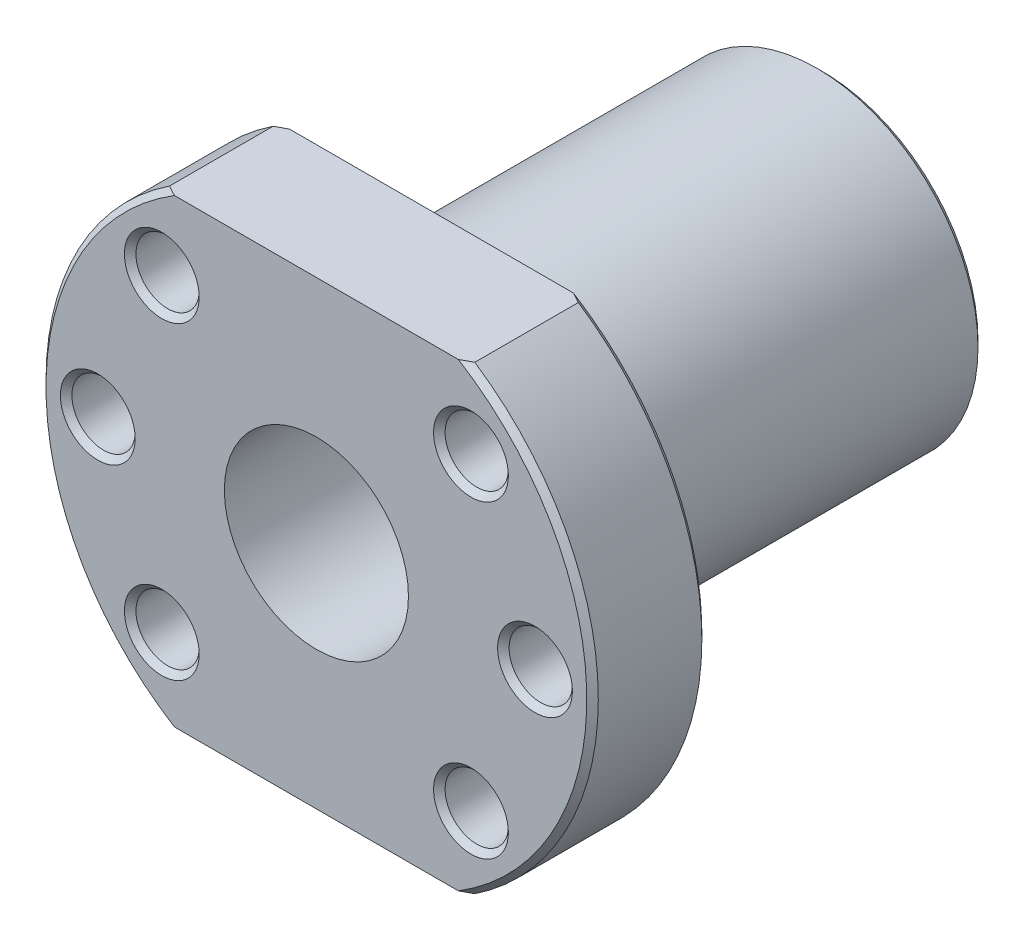
ISO-10303-21;
HEADER;
FILE_DESCRIPTION(('STEP AP214'),'2;1');
FILE_NAME('part.step','',(''),(''),'','','');
FILE_SCHEMA(('AUTOMOTIVE_DESIGN { 1 0 10303 214 1 1 1 1 }'));
ENDSEC;
DATA;
#1=APPLICATION_CONTEXT('core data for automotive mechanical design processes');
#2=APPLICATION_PROTOCOL_DEFINITION('international standard','automotive_design',2000,#1);
#3=PRODUCT_CONTEXT('',#1,'mechanical');
#4=PRODUCT('Part','Part','',(#3));
#5=PRODUCT_RELATED_PRODUCT_CATEGORY('part','',(#4));
#6=PRODUCT_DEFINITION_FORMATION('','',#4);
#7=PRODUCT_DEFINITION_CONTEXT('part definition',#1,'design');
#8=PRODUCT_DEFINITION('design','',#6,#7);
#9=PRODUCT_DEFINITION_SHAPE('','',#8);
#10=(LENGTH_UNIT() NAMED_UNIT(*) SI_UNIT(.MILLI.,.METRE.));
#11=(NAMED_UNIT(*) PLANE_ANGLE_UNIT() SI_UNIT($,.RADIAN.));
#12=(NAMED_UNIT(*) SI_UNIT($,.STERADIAN.) SOLID_ANGLE_UNIT());
#13=UNCERTAINTY_MEASURE_WITH_UNIT(LENGTH_MEASURE(1.E-05),#10,'distance_accuracy_value','');
#14=(GEOMETRIC_REPRESENTATION_CONTEXT(3) GLOBAL_UNCERTAINTY_ASSIGNED_CONTEXT((#13)) GLOBAL_UNIT_ASSIGNED_CONTEXT((#10,
#11,#12)) REPRESENTATION_CONTEXT('',''));
#15=CARTESIAN_POINT('',(0.,0.,0.));
#16=DIRECTION('',(0.,0.,1.));
#17=DIRECTION('',(1.,0.,0.));
#18=AXIS2_PLACEMENT_3D('',#15,#16,#17);
#19=CARTESIAN_POINT('',(0.,0.,0.));
#20=DIRECTION('',(0.,0.,1.));
#21=DIRECTION('',(1.,0.,0.));
#22=AXIS2_PLACEMENT_3D('',#19,#20,#21);
#23=PLANE('',#22);
#24=CARTESIAN_POINT('',(19.,0.,0.));
#25=DIRECTION('',(0.,0.,1.));
#26=DIRECTION('',(1.,0.,0.));
#27=AXIS2_PLACEMENT_3D('',#24,#25,#26);
#28=CIRCLE('',#27,2.75);
#29=CARTESIAN_POINT('',(21.75,0.,0.));
#30=VERTEX_POINT('',#29);
#31=EDGE_CURVE('E298',#30,#30,#28,.T.);
#32=ORIENTED_EDGE('',*,*,#31,.T.);
#33=EDGE_LOOP('',(#32));
#34=FACE_BOUND('',#33,.T.);
#35=CARTESIAN_POINT('',(0.,0.,0.));
#36=DIRECTION('',(0.,0.,1.));
#37=DIRECTION('',(1.,0.,0.));
#38=AXIS2_PLACEMENT_3D('',#35,#36,#37);
#39=CIRCLE('',#38,14.);
#40=CARTESIAN_POINT('',(14.,0.,0.));
#41=VERTEX_POINT('',#40);
#42=EDGE_CURVE('E222',#41,#41,#39,.F.);
#43=ORIENTED_EDGE('',*,*,#42,.F.);
#44=EDGE_LOOP('',(#43));
#45=FACE_BOUND('',#44,.T.);
#46=DIRECTION('',(-1.,0.,0.));
#47=VECTOR('',#46,1.);
#48=CARTESIAN_POINT('',(-44.2311612413135,20.,0.));
#49=LINE('',#48,#47);
#50=CARTESIAN_POINT('',(12.3389626792531,20.,0.));
#51=VERTEX_POINT('',#50);
#52=CARTESIAN_POINT('',(-12.3389626792531,20.,0.));
#53=VERTEX_POINT('',#52);
#54=EDGE_CURVE('E220',#51,#53,#49,.T.);
#55=ORIENTED_EDGE('',*,*,#54,.F.);
#56=CARTESIAN_POINT('',(0.,0.,0.));
#57=DIRECTION('',(0.,0.,1.));
#58=DIRECTION('',(1.,0.,0.));
#59=AXIS2_PLACEMENT_3D('',#56,#57,#58);
#60=CIRCLE('',#59,23.5);
#61=CARTESIAN_POINT('',(12.3389626792531,-20.,0.));
#62=VERTEX_POINT('',#61);
#63=EDGE_CURVE('E559',#51,#62,#60,.F.);
#64=ORIENTED_EDGE('',*,*,#63,.T.);
#65=DIRECTION('',(1.,0.,0.));
#66=VECTOR('',#65,1.);
#67=CARTESIAN_POINT('',(-33.7730280926252,-20.,0.));
#68=LINE('',#67,#66);
#69=CARTESIAN_POINT('',(-12.3389626792531,-20.,0.));
#70=VERTEX_POINT('',#69);
#71=EDGE_CURVE('E107',#70,#62,#68,.T.);
#72=ORIENTED_EDGE('',*,*,#71,.F.);
#73=CARTESIAN_POINT('',(0.,0.,0.));
#74=DIRECTION('',(0.,0.,1.));
#75=DIRECTION('',(1.,0.,0.));
#76=AXIS2_PLACEMENT_3D('',#73,#74,#75);
#77=CIRCLE('',#76,23.5);
#78=EDGE_CURVE('E556',#70,#53,#77,.F.);
#79=ORIENTED_EDGE('',*,*,#78,.T.);
#80=EDGE_LOOP('',(#55,#64,#72,#79));
#81=FACE_BOUND('',#80,.T.);
#82=CARTESIAN_POINT('',(-13.4350288425444,13.4350288425444,0.));
#83=DIRECTION('',(0.,0.,1.));
#84=DIRECTION('',(1.,0.,0.));
#85=AXIS2_PLACEMENT_3D('',#82,#83,#84);
#86=CIRCLE('',#85,2.75);
#87=CARTESIAN_POINT('',(-10.6850288425444,13.4350288425444,0.));
#88=VERTEX_POINT('',#87);
#89=EDGE_CURVE('E284',#88,#88,#86,.F.);
#90=ORIENTED_EDGE('',*,*,#89,.F.);
#91=EDGE_LOOP('',(#90));
#92=FACE_BOUND('',#91,.T.);
#93=CARTESIAN_POINT('',(-19.,0.,0.));
#94=DIRECTION('',(0.,0.,1.));
#95=DIRECTION('',(1.,0.,0.));
#96=AXIS2_PLACEMENT_3D('',#93,#94,#95);
#97=CIRCLE('',#96,2.75);
#98=CARTESIAN_POINT('',(-16.25,0.,0.));
#99=VERTEX_POINT('',#98);
#100=EDGE_CURVE('E289',#99,#99,#97,.F.);
#101=ORIENTED_EDGE('',*,*,#100,.F.);
#102=EDGE_LOOP('',(#101));
#103=FACE_BOUND('',#102,.T.);
#104=CARTESIAN_POINT('',(-13.4350288425443,-13.4350288425445,0.));
#105=DIRECTION('',(0.,0.,1.));
#106=DIRECTION('',(1.,0.,0.));
#107=AXIS2_PLACEMENT_3D('',#104,#105,#106);
#108=CIRCLE('',#107,2.75);
#109=CARTESIAN_POINT('',(-10.6850288425443,-13.4350288425445,0.));
#110=VERTEX_POINT('',#109);
#111=EDGE_CURVE('E292',#110,#110,#108,.F.);
#112=ORIENTED_EDGE('',*,*,#111,.F.);
#113=EDGE_LOOP('',(#112));
#114=FACE_BOUND('',#113,.T.);
#115=CARTESIAN_POINT('',(13.4350288425444,13.4350288425444,0.));
#116=DIRECTION('',(0.,0.,1.));
#117=DIRECTION('',(1.,0.,0.));
#118=AXIS2_PLACEMENT_3D('',#115,#116,#117);
#119=CIRCLE('',#118,2.75);
#120=CARTESIAN_POINT('',(16.1850288425444,13.4350288425444,0.));
#121=VERTEX_POINT('',#120);
#122=EDGE_CURVE('E295',#121,#121,#119,.T.);
#123=ORIENTED_EDGE('',*,*,#122,.T.);
#124=EDGE_LOOP('',(#123));
#125=FACE_BOUND('',#124,.T.);
#126=CARTESIAN_POINT('',(13.4350288425443,-13.4350288425445,0.));
#127=DIRECTION('',(0.,0.,1.));
#128=DIRECTION('',(1.,0.,0.));
#129=AXIS2_PLACEMENT_3D('',#126,#127,#128);
#130=CIRCLE('',#129,2.75);
#131=CARTESIAN_POINT('',(16.1850288425443,-13.4350288425445,0.));
#132=VERTEX_POINT('',#131);
#133=EDGE_CURVE('E301',#132,#132,#130,.T.);
#134=ORIENTED_EDGE('',*,*,#133,.T.);
#135=EDGE_LOOP('',(#134));
#136=FACE_BOUND('',#135,.T.);
#137=ADVANCED_FACE('F34',(#34,#45,#81,#92,#103,#114,#125,#136),#23,.F.);
#138=CARTESIAN_POINT('',(0.,0.,10.));
#139=DIRECTION('',(0.,0.,1.));
#140=DIRECTION('',(1.,0.,0.));
#141=AXIS2_PLACEMENT_3D('',#138,#139,#140);
#142=PLANE('',#141);
#143=CARTESIAN_POINT('',(13.4350288425443,-13.4350288425445,10.));
#144=DIRECTION('',(0.,0.,1.));
#145=DIRECTION('',(1.,0.,0.));
#146=AXIS2_PLACEMENT_3D('',#143,#144,#145);
#147=CIRCLE('',#146,3.25);
#148=CARTESIAN_POINT('',(16.6850288425443,-13.4350288425445,10.));
#149=VERTEX_POINT('',#148);
#150=EDGE_CURVE('E249',#149,#149,#147,.F.);
#151=ORIENTED_EDGE('',*,*,#150,.T.);
#152=EDGE_LOOP('',(#151));
#153=FACE_BOUND('',#152,.T.);
#154=CARTESIAN_POINT('',(19.,0.,10.));
#155=DIRECTION('',(0.,0.,1.));
#156=DIRECTION('',(1.,0.,0.));
#157=AXIS2_PLACEMENT_3D('',#154,#155,#156);
#158=CIRCLE('',#157,3.25);
#159=CARTESIAN_POINT('',(22.25,0.,10.));
#160=VERTEX_POINT('',#159);
#161=EDGE_CURVE('E246',#160,#160,#158,.F.);
#162=ORIENTED_EDGE('',*,*,#161,.T.);
#163=EDGE_LOOP('',(#162));
#164=FACE_BOUND('',#163,.T.);
#165=CARTESIAN_POINT('',(13.4350288425444,13.4350288425444,10.));
#166=DIRECTION('',(0.,0.,1.));
#167=DIRECTION('',(1.,0.,0.));
#168=AXIS2_PLACEMENT_3D('',#165,#166,#167);
#169=CIRCLE('',#168,3.25000000000001);
#170=CARTESIAN_POINT('',(16.6850288425444,13.4350288425444,10.));
#171=VERTEX_POINT('',#170);
#172=EDGE_CURVE('E243',#171,#171,#169,.F.);
#173=ORIENTED_EDGE('',*,*,#172,.T.);
#174=EDGE_LOOP('',(#173));
#175=FACE_BOUND('',#174,.T.);
#176=DIRECTION('',(-1.,0.,0.));
#177=VECTOR('',#176,1.);
#178=CARTESIAN_POINT('',(-33.7730280926252,-20.,10.));
#179=LINE('',#178,#177);
#180=CARTESIAN_POINT('',(12.3389626792531,-20.,10.));
#181=VERTEX_POINT('',#180);
#182=CARTESIAN_POINT('',(-12.3389626792531,-20.,10.));
#183=VERTEX_POINT('',#182);
#184=EDGE_CURVE('E122',#181,#183,#179,.T.);
#185=ORIENTED_EDGE('',*,*,#184,.F.);
#186=CARTESIAN_POINT('',(0.,0.,10.));
#187=DIRECTION('',(0.,0.,1.));
#188=DIRECTION('',(1.,0.,0.));
#189=AXIS2_PLACEMENT_3D('',#186,#187,#188);
#190=CIRCLE('',#189,23.5);
#191=CARTESIAN_POINT('',(12.3389626792531,20.,10.));
#192=VERTEX_POINT('',#191);
#193=EDGE_CURVE('E191',#181,#192,#190,.T.);
#194=ORIENTED_EDGE('',*,*,#193,.T.);
#195=DIRECTION('',(1.,0.,0.));
#196=VECTOR('',#195,1.);
#197=CARTESIAN_POINT('',(-44.2311612413135,20.,10.));
#198=LINE('',#197,#196);
#199=CARTESIAN_POINT('',(-12.3389626792531,20.,10.));
#200=VERTEX_POINT('',#199);
#201=EDGE_CURVE('E205',#200,#192,#198,.T.);
#202=ORIENTED_EDGE('',*,*,#201,.F.);
#203=CARTESIAN_POINT('',(0.,0.,10.));
#204=DIRECTION('',(0.,0.,1.));
#205=DIRECTION('',(1.,0.,0.));
#206=AXIS2_PLACEMENT_3D('',#203,#204,#205);
#207=CIRCLE('',#206,23.5);
#208=EDGE_CURVE('E111',#200,#183,#207,.T.);
#209=ORIENTED_EDGE('',*,*,#208,.T.);
#210=EDGE_LOOP('',(#185,#194,#202,#209));
#211=FACE_BOUND('',#210,.T.);
#212=CARTESIAN_POINT('',(0.,0.,10.));
#213=DIRECTION('',(0.,0.,1.));
#214=DIRECTION('',(1.,0.,0.));
#215=AXIS2_PLACEMENT_3D('',#212,#213,#214);
#216=CIRCLE('',#215,8.);
#217=CARTESIAN_POINT('',(8.,0.,10.));
#218=VERTEX_POINT('',#217);
#219=EDGE_CURVE('E281',#218,#218,#216,.F.);
#220=ORIENTED_EDGE('',*,*,#219,.T.);
#221=EDGE_LOOP('',(#220));
#222=FACE_BOUND('',#221,.T.);
#223=CARTESIAN_POINT('',(-13.4350288425444,13.4350288425444,10.));
#224=DIRECTION('',(0.,0.,1.));
#225=DIRECTION('',(1.,0.,0.));
#226=AXIS2_PLACEMENT_3D('',#223,#224,#225);
#227=CIRCLE('',#226,3.25000000000001);
#228=CARTESIAN_POINT('',(-10.1850288425444,13.4350288425444,10.));
#229=VERTEX_POINT('',#228);
#230=EDGE_CURVE('E228',#229,#229,#227,.F.);
#231=ORIENTED_EDGE('',*,*,#230,.T.);
#232=EDGE_LOOP('',(#231));
#233=FACE_BOUND('',#232,.T.);
#234=CARTESIAN_POINT('',(-19.,0.,10.));
#235=DIRECTION('',(0.,0.,1.));
#236=DIRECTION('',(1.,0.,0.));
#237=AXIS2_PLACEMENT_3D('',#234,#235,#236);
#238=CIRCLE('',#237,3.24999999999997);
#239=CARTESIAN_POINT('',(-15.75,0.,10.));
#240=VERTEX_POINT('',#239);
#241=EDGE_CURVE('E231',#240,#240,#238,.F.);
#242=ORIENTED_EDGE('',*,*,#241,.T.);
#243=EDGE_LOOP('',(#242));
#244=FACE_BOUND('',#243,.T.);
#245=CARTESIAN_POINT('',(-13.4350288425443,-13.4350288425445,10.));
#246=DIRECTION('',(0.,0.,1.));
#247=DIRECTION('',(1.,0.,0.));
#248=AXIS2_PLACEMENT_3D('',#245,#246,#247);
#249=CIRCLE('',#248,3.24999999999999);
#250=CARTESIAN_POINT('',(-10.1850288425443,-13.4350288425445,10.));
#251=VERTEX_POINT('',#250);
#252=EDGE_CURVE('E234',#251,#251,#249,.F.);
#253=ORIENTED_EDGE('',*,*,#252,.T.);
#254=EDGE_LOOP('',(#253));
#255=FACE_BOUND('',#254,.T.);
#256=ADVANCED_FACE('F211',(#153,#164,#175,#211,#222,#233,#244,#255),#142,.T.);
#257=CARTESIAN_POINT('',(0.,0.,10.));
#258=DIRECTION('',(0.,0.,-1.));
#259=DIRECTION('',(-1.,0.,0.));
#260=AXIS2_PLACEMENT_3D('',#257,#258,#259);
#261=CYLINDRICAL_SURFACE('',#260,24.);
#262=DIRECTION('',(0.,0.,-1.));
#263=VECTOR('',#262,1.);
#264=CARTESIAN_POINT('',(13.2664991614216,-20.,10.));
#265=LINE('',#264,#263);
#266=CARTESIAN_POINT('',(13.2664991614216,-20.,0.499999999999997));
#267=VERTEX_POINT('',#266);
#268=CARTESIAN_POINT('',(13.2664991614216,-20.,9.5));
#269=VERTEX_POINT('',#268);
#270=EDGE_CURVE('E104',#267,#269,#265,.F.);
#271=ORIENTED_EDGE('',*,*,#270,.F.);
#272=CARTESIAN_POINT('',(0.,0.,0.499999999999997));
#273=DIRECTION('',(0.,0.,1.));
#274=DIRECTION('',(1.,0.,0.));
#275=AXIS2_PLACEMENT_3D('',#272,#273,#274);
#276=CIRCLE('',#275,24.);
#277=CARTESIAN_POINT('',(13.2664991614216,20.,0.499999999999997));
#278=VERTEX_POINT('',#277);
#279=EDGE_CURVE('E118',#267,#278,#276,.T.);
#280=ORIENTED_EDGE('',*,*,#279,.T.);
#281=DIRECTION('',(0.,0.,-1.));
#282=VECTOR('',#281,1.);
#283=CARTESIAN_POINT('',(13.2664991614216,20.,10.));
#284=LINE('',#283,#282);
#285=CARTESIAN_POINT('',(13.2664991614216,20.,9.5));
#286=VERTEX_POINT('',#285);
#287=EDGE_CURVE('E206',#286,#278,#284,.T.);
#288=ORIENTED_EDGE('',*,*,#287,.F.);
#289=CARTESIAN_POINT('',(0.,0.,9.5));
#290=DIRECTION('',(0.,0.,1.));
#291=DIRECTION('',(1.,0.,0.));
#292=AXIS2_PLACEMENT_3D('',#289,#290,#291);
#293=CIRCLE('',#292,24.);
#294=EDGE_CURVE('E121',#286,#269,#293,.F.);
#295=ORIENTED_EDGE('',*,*,#294,.T.);
#296=EDGE_LOOP('',(#271,#280,#288,#295));
#297=FACE_BOUND('',#296,.T.);
#298=ADVANCED_FACE('F116',(#297),#261,.T.);
#299=DIRECTION('',(0.,0.,-1.));
#300=VECTOR('',#299,1.);
#301=CARTESIAN_POINT('',(-13.2664991614216,20.,10.));
#302=LINE('',#301,#300);
#303=CARTESIAN_POINT('',(-13.2664991614216,20.,0.499999999999997));
#304=VERTEX_POINT('',#303);
#305=CARTESIAN_POINT('',(-13.2664991614216,20.,9.5));
#306=VERTEX_POINT('',#305);
#307=EDGE_CURVE('E198',#304,#306,#302,.F.);
#308=ORIENTED_EDGE('',*,*,#307,.F.);
#309=CARTESIAN_POINT('',(0.,0.,0.499999999999997));
#310=DIRECTION('',(0.,0.,1.));
#311=DIRECTION('',(1.,0.,0.));
#312=AXIS2_PLACEMENT_3D('',#309,#310,#311);
#313=CIRCLE('',#312,24.);
#314=CARTESIAN_POINT('',(-13.2664991614216,-20.,0.499999999999997));
#315=VERTEX_POINT('',#314);
#316=EDGE_CURVE('E11',#304,#315,#313,.T.);
#317=ORIENTED_EDGE('',*,*,#316,.T.);
#318=DIRECTION('',(0.,0.,-1.));
#319=VECTOR('',#318,1.);
#320=CARTESIAN_POINT('',(-13.2664991614216,-20.,10.));
#321=LINE('',#320,#319);
#322=CARTESIAN_POINT('',(-13.2664991614216,-20.,9.5));
#323=VERTEX_POINT('',#322);
#324=EDGE_CURVE('E123',#323,#315,#321,.T.);
#325=ORIENTED_EDGE('',*,*,#324,.F.);
#326=CARTESIAN_POINT('',(0.,0.,9.5));
#327=DIRECTION('',(0.,0.,1.));
#328=DIRECTION('',(1.,0.,0.));
#329=AXIS2_PLACEMENT_3D('',#326,#327,#328);
#330=CIRCLE('',#329,24.);
#331=EDGE_CURVE('E43',#323,#306,#330,.F.);
#332=ORIENTED_EDGE('',*,*,#331,.T.);
#333=EDGE_LOOP('',(#308,#317,#325,#332));
#334=FACE_BOUND('',#333,.T.);
#335=ADVANCED_FACE('F197',(#334),#261,.T.);
#336=CARTESIAN_POINT('',(0.,0.,-34.));
#337=DIRECTION('',(0.,0.,1.));
#338=DIRECTION('',(1.,0.,0.));
#339=AXIS2_PLACEMENT_3D('',#336,#337,#338);
#340=CYLINDRICAL_SURFACE('',#339,14.);
#341=CARTESIAN_POINT('',(0.,0.,-33.5));
#342=DIRECTION('',(0.,0.,-1.));
#343=DIRECTION('',(-1.,0.,0.));
#344=AXIS2_PLACEMENT_3D('',#341,#342,#343);
#345=CIRCLE('',#344,14.);
#346=CARTESIAN_POINT('',(-14.,0.,-33.5));
#347=VERTEX_POINT('',#346);
#348=EDGE_CURVE('E131',#347,#347,#345,.F.);
#349=ORIENTED_EDGE('',*,*,#348,.T.);
#350=EDGE_LOOP('',(#349));
#351=FACE_BOUND('',#350,.T.);
#352=ORIENTED_EDGE('',*,*,#42,.T.);
#353=EDGE_LOOP('',(#352));
#354=FACE_BOUND('',#353,.T.);
#355=ADVANCED_FACE('F266',(#351,#354),#340,.T.);
#356=CARTESIAN_POINT('',(0.,0.,-34.));
#357=DIRECTION('',(0.,0.,-1.));
#358=DIRECTION('',(-1.,0.,0.));
#359=AXIS2_PLACEMENT_3D('',#356,#357,#358);
#360=PLANE('',#359);
#361=CARTESIAN_POINT('',(0.,0.,-34.));
#362=DIRECTION('',(0.,0.,-1.));
#363=DIRECTION('',(-1.,0.,0.));
#364=AXIS2_PLACEMENT_3D('',#361,#362,#363);
#365=CIRCLE('',#364,13.5);
#366=CARTESIAN_POINT('',(-13.5,0.,-34.));
#367=VERTEX_POINT('',#366);
#368=EDGE_CURVE('E261',#367,#367,#365,.T.);
#369=ORIENTED_EDGE('',*,*,#368,.T.);
#370=EDGE_LOOP('',(#369));
#371=FACE_BOUND('',#370,.T.);
#372=CARTESIAN_POINT('',(0.,0.,-34.));
#373=DIRECTION('',(0.,0.,-1.));
#374=DIRECTION('',(-1.,0.,0.));
#375=AXIS2_PLACEMENT_3D('',#372,#373,#374);
#376=CIRCLE('',#375,8.);
#377=CARTESIAN_POINT('',(-8.,0.,-34.));
#378=VERTEX_POINT('',#377);
#379=EDGE_CURVE('E279',#378,#378,#376,.T.);
#380=ORIENTED_EDGE('',*,*,#379,.F.);
#381=EDGE_LOOP('',(#380));
#382=FACE_BOUND('',#381,.T.);
#383=ADVANCED_FACE('F148',(#371,#382),#360,.T.);
#384=CARTESIAN_POINT('',(-44.2311612413135,20.,-34.001));
#385=DIRECTION('',(0.,-1.,0.));
#386=DIRECTION('',(0.,0.,-1.));
#387=AXIS2_PLACEMENT_3D('',#384,#385,#386);
#388=PLANE('',#387);
#389=ORIENTED_EDGE('',*,*,#287,.T.);
#390=CARTESIAN_POINT('',(13.2664991614216,20.,0.499999999999997));
#391=CARTESIAN_POINT('',(13.1128042922851,20.,0.41500733347907));
#392=CARTESIAN_POINT('',(12.9586621744438,20.,0.33084434593532));
#393=CARTESIAN_POINT('',(12.6494833475968,20.,0.164177678262288));
#394=CARTESIAN_POINT('',(12.4944466380485,20.,0.0816739991393728));
#395=CARTESIAN_POINT('',(12.3389626792531,20.,0.));
#396=B_SPLINE_CURVE_WITH_KNOTS('',3,(#390,#391,#392,#393,#394,#395),.UNSPECIFIED.,.F.,.F.,(4,2,
4),(0.,0.526866974371925,1.05373426827748),.UNSPECIFIED.);
#397=EDGE_CURVE('E126',#278,#51,#396,.T.);
#398=ORIENTED_EDGE('',*,*,#397,.T.);
#399=ORIENTED_EDGE('',*,*,#54,.T.);
#400=CARTESIAN_POINT('',(-12.3389626792531,20.,0.));
#401=CARTESIAN_POINT('',(-12.4944466380485,20.,0.0816739991393734));
#402=CARTESIAN_POINT('',(-12.6494833475968,20.,0.164177678262289));
#403=CARTESIAN_POINT('',(-12.9586621744438,20.,0.33084434593532));
#404=CARTESIAN_POINT('',(-13.1128042922851,20.,0.415007333479071));
#405=CARTESIAN_POINT('',(-13.2664991614216,20.,0.499999999999998));
#406=B_SPLINE_CURVE_WITH_KNOTS('',3,(#400,#401,#402,#403,#404,#405),.UNSPECIFIED.,.F.,.F.,(4,2,
4),(0.,0.526867293905557,1.05373426827748),.UNSPECIFIED.);
#407=EDGE_CURVE('E129',#53,#304,#406,.T.);
#408=ORIENTED_EDGE('',*,*,#407,.T.);
#409=ORIENTED_EDGE('',*,*,#307,.T.);
#410=CARTESIAN_POINT('',(-13.2664991614216,20.,9.5));
#411=CARTESIAN_POINT('',(-13.1128042922851,20.,9.58499266652093));
#412=CARTESIAN_POINT('',(-12.9586621744438,20.,9.66915565406468));
#413=CARTESIAN_POINT('',(-12.6494833475968,20.,9.83582232173771));
#414=CARTESIAN_POINT('',(-12.4944466380485,20.,9.91832600086063));
#415=CARTESIAN_POINT('',(-12.3389626792531,20.,10.));
#416=B_SPLINE_CURVE_WITH_KNOTS('',3,(#410,#411,#412,#413,#414,#415),.UNSPECIFIED.,.F.,.F.,(4,2,
4),(0.,0.526866974371928,1.05373426827749),.UNSPECIFIED.);
#417=EDGE_CURVE('E127',#306,#200,#416,.T.);
#418=ORIENTED_EDGE('',*,*,#417,.T.);
#419=ORIENTED_EDGE('',*,*,#201,.T.);
#420=CARTESIAN_POINT('',(12.3389626792531,20.,10.));
#421=CARTESIAN_POINT('',(12.4944466380485,20.,9.91832600086063));
#422=CARTESIAN_POINT('',(12.6494833475968,20.,9.83582232173771));
#423=CARTESIAN_POINT('',(12.9586621744438,20.,9.66915565406468));
#424=CARTESIAN_POINT('',(13.1128042922851,20.,9.58499266652093));
#425=CARTESIAN_POINT('',(13.2664991614216,20.,9.5));
#426=B_SPLINE_CURVE_WITH_KNOTS('',3,(#420,#421,#422,#423,#424,#425),.UNSPECIFIED.,.F.,.F.,(4,2,
4),(0.,0.526867293905557,1.05373426827748),.UNSPECIFIED.);
#427=EDGE_CURVE('E157',#192,#286,#426,.T.);
#428=ORIENTED_EDGE('',*,*,#427,.T.);
#429=EDGE_LOOP('',(#389,#398,#399,#408,#409,#418,#419,#428));
#430=FACE_BOUND('',#429,.T.);
#431=ADVANCED_FACE('F143',(#430),#388,.F.);
#432=CARTESIAN_POINT('',(-33.7730280926252,-20.,-34.001));
#433=DIRECTION('',(0.,1.,0.));
#434=DIRECTION('',(0.,0.,1.));
#435=AXIS2_PLACEMENT_3D('',#432,#433,#434);
#436=PLANE('',#435);
#437=ORIENTED_EDGE('',*,*,#71,.T.);
#438=CARTESIAN_POINT('',(12.3389626792531,-20.,0.));
#439=CARTESIAN_POINT('',(12.4944466380485,-20.,0.0816739991393734));
#440=CARTESIAN_POINT('',(12.6494833475968,-20.,0.164177678262289));
#441=CARTESIAN_POINT('',(12.9586621744438,-20.,0.33084434593532));
#442=CARTESIAN_POINT('',(13.1128042922851,-20.,0.415007333479071));
#443=CARTESIAN_POINT('',(13.2664991614216,-20.,0.499999999999998));
#444=B_SPLINE_CURVE_WITH_KNOTS('',3,(#438,#439,#440,#441,#442,#443),.UNSPECIFIED.,.F.,.F.,(4,2,
4),(0.,0.526867293905557,1.05373426827748),.UNSPECIFIED.);
#445=EDGE_CURVE('E101',#62,#267,#444,.T.);
#446=ORIENTED_EDGE('',*,*,#445,.T.);
#447=ORIENTED_EDGE('',*,*,#270,.T.);
#448=CARTESIAN_POINT('',(13.2664991614216,-20.,9.5));
#449=CARTESIAN_POINT('',(13.1128042922851,-20.,9.58499266652093));
#450=CARTESIAN_POINT('',(12.9586621744438,-20.,9.66915565406468));
#451=CARTESIAN_POINT('',(12.6494833475968,-20.,9.83582232173771));
#452=CARTESIAN_POINT('',(12.4944466380485,-20.,9.91832600086063));
#453=CARTESIAN_POINT('',(12.3389626792531,-20.,10.));
#454=B_SPLINE_CURVE_WITH_KNOTS('',3,(#448,#449,#450,#451,#452,#453),.UNSPECIFIED.,.F.,.F.,(4,2,
4),(0.,0.526866974371928,1.05373426827749),.UNSPECIFIED.);
#455=EDGE_CURVE('E112',#269,#181,#454,.T.);
#456=ORIENTED_EDGE('',*,*,#455,.T.);
#457=ORIENTED_EDGE('',*,*,#184,.T.);
#458=CARTESIAN_POINT('',(-12.3389626792531,-20.,10.));
#459=CARTESIAN_POINT('',(-12.4944466380485,-20.,9.91832600086063));
#460=CARTESIAN_POINT('',(-12.6494833475968,-20.,9.83582232173771));
#461=CARTESIAN_POINT('',(-12.9586621744438,-20.,9.66915565406468));
#462=CARTESIAN_POINT('',(-13.1128042922851,-20.,9.58499266652093));
#463=CARTESIAN_POINT('',(-13.2664991614216,-20.,9.5));
#464=B_SPLINE_CURVE_WITH_KNOTS('',3,(#458,#459,#460,#461,#462,#463),.UNSPECIFIED.,.F.,.F.,(4,2,
4),(0.,0.526867293905557,1.05373426827748),.UNSPECIFIED.);
#465=EDGE_CURVE('E57',#183,#323,#464,.T.);
#466=ORIENTED_EDGE('',*,*,#465,.T.);
#467=ORIENTED_EDGE('',*,*,#324,.T.);
#468=CARTESIAN_POINT('',(-13.2664991614216,-20.,0.499999999999997));
#469=CARTESIAN_POINT('',(-13.1128042922851,-20.,0.41500733347907));
#470=CARTESIAN_POINT('',(-12.9586621744438,-20.,0.33084434593532));
#471=CARTESIAN_POINT('',(-12.6494833475968,-20.,0.164177678262288));
#472=CARTESIAN_POINT('',(-12.4944466380485,-20.,0.0816739991393728));
#473=CARTESIAN_POINT('',(-12.3389626792531,-20.,0.));
#474=B_SPLINE_CURVE_WITH_KNOTS('',3,(#468,#469,#470,#471,#472,#473),.UNSPECIFIED.,.F.,.F.,(4,2,
4),(0.,0.526866974371925,1.05373426827748),.UNSPECIFIED.);
#475=EDGE_CURVE('E50',#315,#70,#474,.T.);
#476=ORIENTED_EDGE('',*,*,#475,.T.);
#477=EDGE_LOOP('',(#437,#446,#447,#456,#457,#466,#467,#476));
#478=FACE_BOUND('',#477,.T.);
#479=ADVANCED_FACE('F103',(#478),#436,.F.);
#480=CARTESIAN_POINT('',(0.,0.,10.001));
#481=DIRECTION('',(0.,0.,-1.));
#482=DIRECTION('',(-1.,0.,0.));
#483=AXIS2_PLACEMENT_3D('',#480,#481,#482);
#484=CYLINDRICAL_SURFACE('',#483,8.);
#485=ORIENTED_EDGE('',*,*,#219,.F.);
#486=EDGE_LOOP('',(#485));
#487=FACE_BOUND('',#486,.T.);
#488=ORIENTED_EDGE('',*,*,#379,.T.);
#489=EDGE_LOOP('',(#488));
#490=FACE_BOUND('',#489,.T.);
#491=ADVANCED_FACE('F376',(#487,#490),#484,.F.);
#492=CARTESIAN_POINT('',(-13.4350288425444,13.4350288425444,-34.001));
#493=DIRECTION('',(0.,0.,1.));
#494=DIRECTION('',(1.,0.,0.));
#495=AXIS2_PLACEMENT_3D('',#492,#493,#494);
#496=CYLINDRICAL_SURFACE('',#495,2.75);
#497=CARTESIAN_POINT('',(-13.4350288425444,13.4350288425444,9.49999999999999));
#498=DIRECTION('',(0.,0.,1.));
#499=DIRECTION('',(1.,0.,0.));
#500=AXIS2_PLACEMENT_3D('',#497,#498,#499);
#501=CIRCLE('',#500,2.75);
#502=CARTESIAN_POINT('',(-10.6850288425444,13.4350288425444,9.49999999999999));
#503=VERTEX_POINT('',#502);
#504=EDGE_CURVE('E240',#503,#503,#501,.T.);
#505=ORIENTED_EDGE('',*,*,#504,.T.);
#506=EDGE_LOOP('',(#505));
#507=FACE_BOUND('',#506,.T.);
#508=ORIENTED_EDGE('',*,*,#89,.T.);
#509=EDGE_LOOP('',(#508));
#510=FACE_BOUND('',#509,.T.);
#511=ADVANCED_FACE('F373',(#507,#510),#496,.F.);
#512=CARTESIAN_POINT('',(-19.,0.,-34.001));
#513=DIRECTION('',(0.,0.,1.));
#514=DIRECTION('',(1.,0.,0.));
#515=AXIS2_PLACEMENT_3D('',#512,#513,#514);
#516=CYLINDRICAL_SURFACE('',#515,2.75);
#517=CARTESIAN_POINT('',(-19.,0.,9.50000000000002));
#518=DIRECTION('',(0.,0.,1.));
#519=DIRECTION('',(1.,0.,0.));
#520=AXIS2_PLACEMENT_3D('',#517,#518,#519);
#521=CIRCLE('',#520,2.75);
#522=CARTESIAN_POINT('',(-16.25,0.,9.50000000000002));
#523=VERTEX_POINT('',#522);
#524=EDGE_CURVE('E237',#523,#523,#521,.T.);
#525=ORIENTED_EDGE('',*,*,#524,.T.);
#526=EDGE_LOOP('',(#525));
#527=FACE_BOUND('',#526,.T.);
#528=ORIENTED_EDGE('',*,*,#100,.T.);
#529=EDGE_LOOP('',(#528));
#530=FACE_BOUND('',#529,.T.);
#531=ADVANCED_FACE('F369',(#527,#530),#516,.F.);
#532=CARTESIAN_POINT('',(-13.4350288425443,-13.4350288425445,-34.001));
#533=DIRECTION('',(0.,0.,1.));
#534=DIRECTION('',(1.,0.,0.));
#535=AXIS2_PLACEMENT_3D('',#532,#533,#534);
#536=CYLINDRICAL_SURFACE('',#535,2.75);
#537=CARTESIAN_POINT('',(-13.4350288425443,-13.4350288425445,9.50000000000001));
#538=DIRECTION('',(0.,0.,1.));
#539=DIRECTION('',(1.,0.,0.));
#540=AXIS2_PLACEMENT_3D('',#537,#538,#539);
#541=CIRCLE('',#540,2.75);
#542=CARTESIAN_POINT('',(-10.6850288425443,-13.4350288425445,9.50000000000001));
#543=VERTEX_POINT('',#542);
#544=EDGE_CURVE('E225',#543,#543,#541,.T.);
#545=ORIENTED_EDGE('',*,*,#544,.T.);
#546=EDGE_LOOP('',(#545));
#547=FACE_BOUND('',#546,.T.);
#548=ORIENTED_EDGE('',*,*,#111,.T.);
#549=EDGE_LOOP('',(#548));
#550=FACE_BOUND('',#549,.T.);
#551=ADVANCED_FACE('F338',(#547,#550),#536,.F.);
#552=CARTESIAN_POINT('',(-13.4350288425443,-13.4350288425445,9.50000000000001));
#553=DIRECTION('',(0.,0.,1.));
#554=DIRECTION('',(1.,0.,0.));
#555=AXIS2_PLACEMENT_3D('',#552,#553,#554);
#556=CONICAL_SURFACE('',#555,2.75,0.785398163397451);
#557=ORIENTED_EDGE('',*,*,#252,.F.);
#558=EDGE_LOOP('',(#557));
#559=FACE_BOUND('',#558,.T.);
#560=ORIENTED_EDGE('',*,*,#544,.F.);
#561=EDGE_LOOP('',(#560));
#562=FACE_BOUND('',#561,.T.);
#563=ADVANCED_FACE('F334',(#559,#562),#556,.F.);
#564=CARTESIAN_POINT('',(-19.,0.,9.50000000000002));
#565=DIRECTION('',(0.,0.,1.));
#566=DIRECTION('',(1.,0.,0.));
#567=AXIS2_PLACEMENT_3D('',#564,#565,#566);
#568=CONICAL_SURFACE('',#567,2.75,0.785398163397446);
#569=ORIENTED_EDGE('',*,*,#241,.F.);
#570=EDGE_LOOP('',(#569));
#571=FACE_BOUND('',#570,.T.);
#572=ORIENTED_EDGE('',*,*,#524,.F.);
#573=EDGE_LOOP('',(#572));
#574=FACE_BOUND('',#573,.T.);
#575=ADVANCED_FACE('F337',(#571,#574),#568,.F.);
#576=CARTESIAN_POINT('',(-13.4350288425444,13.4350288425444,9.49999999999999));
#577=DIRECTION('',(0.,0.,1.));
#578=DIRECTION('',(1.,0.,0.));
#579=AXIS2_PLACEMENT_3D('',#576,#577,#578);
#580=CONICAL_SURFACE('',#579,2.75,0.785398163397451);
#581=ORIENTED_EDGE('',*,*,#230,.F.);
#582=EDGE_LOOP('',(#581));
#583=FACE_BOUND('',#582,.T.);
#584=ORIENTED_EDGE('',*,*,#504,.F.);
#585=EDGE_LOOP('',(#584));
#586=FACE_BOUND('',#585,.T.);
#587=ADVANCED_FACE('F342',(#583,#586),#580,.F.);
#588=CARTESIAN_POINT('',(13.4350288425444,13.4350288425444,-34.001));
#589=DIRECTION('',(0.,0.,1.));
#590=DIRECTION('',(1.,0.,0.));
#591=AXIS2_PLACEMENT_3D('',#588,#589,#590);
#592=CYLINDRICAL_SURFACE('',#591,2.75);
#593=CARTESIAN_POINT('',(13.4350288425444,13.4350288425444,9.49999999999999));
#594=DIRECTION('',(0.,0.,1.));
#595=DIRECTION('',(1.,0.,0.));
#596=AXIS2_PLACEMENT_3D('',#593,#594,#595);
#597=CIRCLE('',#596,2.75);
#598=CARTESIAN_POINT('',(16.1850288425444,13.4350288425444,9.49999999999999));
#599=VERTEX_POINT('',#598);
#600=EDGE_CURVE('E258',#599,#599,#597,.T.);
#601=ORIENTED_EDGE('',*,*,#600,.T.);
#602=EDGE_LOOP('',(#601));
#603=FACE_BOUND('',#602,.T.);
#604=ORIENTED_EDGE('',*,*,#122,.F.);
#605=EDGE_LOOP('',(#604));
#606=FACE_BOUND('',#605,.T.);
#607=ADVANCED_FACE('F319',(#603,#606),#592,.F.);
#608=CARTESIAN_POINT('',(19.,0.,-34.001));
#609=DIRECTION('',(0.,0.,1.));
#610=DIRECTION('',(1.,0.,0.));
#611=AXIS2_PLACEMENT_3D('',#608,#609,#610);
#612=CYLINDRICAL_SURFACE('',#611,2.75);
#613=CARTESIAN_POINT('',(19.,0.,9.49999999999999));
#614=DIRECTION('',(0.,0.,1.));
#615=DIRECTION('',(1.,0.,0.));
#616=AXIS2_PLACEMENT_3D('',#613,#614,#615);
#617=CIRCLE('',#616,2.75);
#618=CARTESIAN_POINT('',(21.75,0.,9.49999999999999));
#619=VERTEX_POINT('',#618);
#620=EDGE_CURVE('E255',#619,#619,#617,.T.);
#621=ORIENTED_EDGE('',*,*,#620,.T.);
#622=EDGE_LOOP('',(#621));
#623=FACE_BOUND('',#622,.T.);
#624=ORIENTED_EDGE('',*,*,#31,.F.);
#625=EDGE_LOOP('',(#624));
#626=FACE_BOUND('',#625,.T.);
#627=ADVANCED_FACE('F309',(#623,#626),#612,.F.);
#628=CARTESIAN_POINT('',(13.4350288425443,-13.4350288425445,-34.001));
#629=DIRECTION('',(0.,0.,1.));
#630=DIRECTION('',(1.,0.,0.));
#631=AXIS2_PLACEMENT_3D('',#628,#629,#630);
#632=CYLINDRICAL_SURFACE('',#631,2.75);
#633=CARTESIAN_POINT('',(13.4350288425443,-13.4350288425445,9.49999999999999));
#634=DIRECTION('',(0.,0.,1.));
#635=DIRECTION('',(1.,0.,0.));
#636=AXIS2_PLACEMENT_3D('',#633,#634,#635);
#637=CIRCLE('',#636,2.75);
#638=CARTESIAN_POINT('',(16.1850288425443,-13.4350288425445,9.49999999999999));
#639=VERTEX_POINT('',#638);
#640=EDGE_CURVE('E252',#639,#639,#637,.T.);
#641=ORIENTED_EDGE('',*,*,#640,.T.);
#642=EDGE_LOOP('',(#641));
#643=FACE_BOUND('',#642,.T.);
#644=ORIENTED_EDGE('',*,*,#133,.F.);
#645=EDGE_LOOP('',(#644));
#646=FACE_BOUND('',#645,.T.);
#647=ADVANCED_FACE('F306',(#643,#646),#632,.F.);
#648=CARTESIAN_POINT('',(13.4350288425443,-13.4350288425445,10.));
#649=DIRECTION('',(0.,0.,1.));
#650=DIRECTION('',(1.,0.,0.));
#651=AXIS2_PLACEMENT_3D('',#648,#649,#650);
#652=CONICAL_SURFACE('',#651,3.25,0.785398163397448);
#653=ORIENTED_EDGE('',*,*,#640,.F.);
#654=EDGE_LOOP('',(#653));
#655=FACE_BOUND('',#654,.T.);
#656=ORIENTED_EDGE('',*,*,#150,.F.);
#657=EDGE_LOOP('',(#656));
#658=FACE_BOUND('',#657,.T.);
#659=ADVANCED_FACE('F308',(#655,#658),#652,.F.);
#660=CARTESIAN_POINT('',(19.,0.,10.));
#661=DIRECTION('',(0.,0.,1.));
#662=DIRECTION('',(1.,0.,0.));
#663=AXIS2_PLACEMENT_3D('',#660,#661,#662);
#664=CONICAL_SURFACE('',#663,3.25000000000001,0.785398163397449);
#665=ORIENTED_EDGE('',*,*,#620,.F.);
#666=EDGE_LOOP('',(#665));
#667=FACE_BOUND('',#666,.T.);
#668=ORIENTED_EDGE('',*,*,#161,.F.);
#669=EDGE_LOOP('',(#668));
#670=FACE_BOUND('',#669,.T.);
#671=ADVANCED_FACE('F316',(#667,#670),#664,.F.);
#672=CARTESIAN_POINT('',(13.4350288425444,13.4350288425444,10.));
#673=DIRECTION('',(0.,0.,1.));
#674=DIRECTION('',(1.,0.,0.));
#675=AXIS2_PLACEMENT_3D('',#672,#673,#674);
#676=CONICAL_SURFACE('',#675,3.25000000000001,0.785398163397451);
#677=ORIENTED_EDGE('',*,*,#600,.F.);
#678=EDGE_LOOP('',(#677));
#679=FACE_BOUND('',#678,.T.);
#680=ORIENTED_EDGE('',*,*,#172,.F.);
#681=EDGE_LOOP('',(#680));
#682=FACE_BOUND('',#681,.T.);
#683=ADVANCED_FACE('F272',(#679,#682),#676,.F.);
#684=CARTESIAN_POINT('',(0.,0.,-34.));
#685=DIRECTION('',(0.,0.,1.));
#686=DIRECTION('',(1.,0.,0.));
#687=AXIS2_PLACEMENT_3D('',#684,#685,#686);
#688=CONICAL_SURFACE('',#687,13.5,0.78539816339745);
#689=ORIENTED_EDGE('',*,*,#348,.F.);
#690=EDGE_LOOP('',(#689));
#691=FACE_BOUND('',#690,.T.);
#692=ORIENTED_EDGE('',*,*,#368,.F.);
#693=EDGE_LOOP('',(#692));
#694=FACE_BOUND('',#693,.T.);
#695=ADVANCED_FACE('F269',(#691,#694),#688,.T.);
#696=CARTESIAN_POINT('',(0.,0.,0.499999999999997));
#697=DIRECTION('',(0.,0.,1.));
#698=DIRECTION('',(1.,0.,0.));
#699=AXIS2_PLACEMENT_3D('',#696,#697,#698);
#700=CONICAL_SURFACE('',#699,24.,0.785398163397445);
#701=ORIENTED_EDGE('',*,*,#445,.F.);
#702=ORIENTED_EDGE('',*,*,#63,.F.);
#703=ORIENTED_EDGE('',*,*,#397,.F.);
#704=ORIENTED_EDGE('',*,*,#279,.F.);
#705=EDGE_LOOP('',(#701,#702,#703,#704));
#706=FACE_BOUND('',#705,.T.);
#707=ADVANCED_FACE('F125',(#706),#700,.T.);
#708=CARTESIAN_POINT('',(0.,0.,10.));
#709=DIRECTION('',(0.,0.,-1.));
#710=DIRECTION('',(-1.,0.,0.));
#711=AXIS2_PLACEMENT_3D('',#708,#709,#710);
#712=CONICAL_SURFACE('',#711,23.5,0.785398163397445);
#713=ORIENTED_EDGE('',*,*,#455,.F.);
#714=ORIENTED_EDGE('',*,*,#294,.F.);
#715=ORIENTED_EDGE('',*,*,#427,.F.);
#716=ORIENTED_EDGE('',*,*,#193,.F.);
#717=EDGE_LOOP('',(#713,#714,#715,#716));
#718=FACE_BOUND('',#717,.T.);
#719=ADVANCED_FACE('F167',(#718),#712,.T.);
#720=CARTESIAN_POINT('',(0.,0.,0.499999999999997));
#721=DIRECTION('',(0.,0.,1.));
#722=DIRECTION('',(1.,0.,0.));
#723=AXIS2_PLACEMENT_3D('',#720,#721,#722);
#724=CONICAL_SURFACE('',#723,24.,0.785398163397445);
#725=ORIENTED_EDGE('',*,*,#407,.F.);
#726=ORIENTED_EDGE('',*,*,#78,.F.);
#727=ORIENTED_EDGE('',*,*,#475,.F.);
#728=ORIENTED_EDGE('',*,*,#316,.F.);
#729=EDGE_LOOP('',(#725,#726,#727,#728));
#730=FACE_BOUND('',#729,.T.);
#731=ADVANCED_FACE('F170',(#730),#724,.T.);
#732=CARTESIAN_POINT('',(0.,0.,10.));
#733=DIRECTION('',(0.,0.,-1.));
#734=DIRECTION('',(-1.,0.,0.));
#735=AXIS2_PLACEMENT_3D('',#732,#733,#734);
#736=CONICAL_SURFACE('',#735,23.5,0.785398163397445);
#737=ORIENTED_EDGE('',*,*,#417,.F.);
#738=ORIENTED_EDGE('',*,*,#331,.F.);
#739=ORIENTED_EDGE('',*,*,#465,.F.);
#740=ORIENTED_EDGE('',*,*,#208,.F.);
#741=EDGE_LOOP('',(#737,#738,#739,#740));
#742=FACE_BOUND('',#741,.T.);
#743=ADVANCED_FACE('F36',(#742),#736,.T.);
#744=CLOSED_SHELL('',(#137,#256,#298,#335,#355,#383,#431,#479,#491,#511,#531,#551,#563,#575,
#587,#607,#627,#647,#659,#671,#683,#695,#707,#719,#731,#743));
#745=MANIFOLD_SOLID_BREP('B2',#744);
#746=ADVANCED_BREP_SHAPE_REPRESENTATION('',(#18,#745),#14);
#747=SHAPE_DEFINITION_REPRESENTATION(#9,#746);
ENDSEC;
END-ISO-10303-21;
